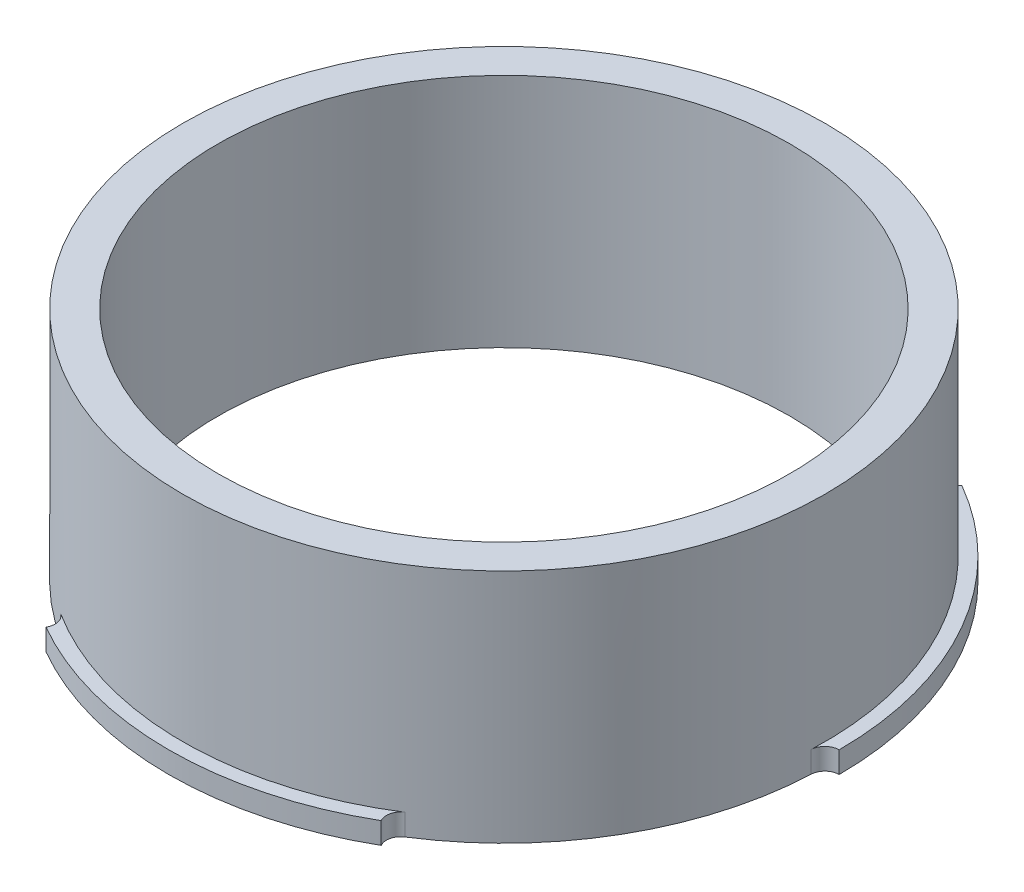
ISO-10303-21;
HEADER;
FILE_DESCRIPTION(('STEP AP214'),'2;1');
FILE_NAME('part.step','',(''),(''),'','','');
FILE_SCHEMA(('AUTOMOTIVE_DESIGN { 1 0 10303 214 1 1 1 1 }'));
ENDSEC;
DATA;
#1=APPLICATION_CONTEXT('core data for automotive mechanical design processes');
#2=APPLICATION_PROTOCOL_DEFINITION('international standard','automotive_design',2000,#1);
#3=PRODUCT_CONTEXT('',#1,'mechanical');
#4=PRODUCT('Part','Part','',(#3));
#5=PRODUCT_RELATED_PRODUCT_CATEGORY('part','',(#4));
#6=PRODUCT_DEFINITION_FORMATION('','',#4);
#7=PRODUCT_DEFINITION_CONTEXT('part definition',#1,'design');
#8=PRODUCT_DEFINITION('design','',#6,#7);
#9=PRODUCT_DEFINITION_SHAPE('','',#8);
#10=(LENGTH_UNIT() NAMED_UNIT(*) SI_UNIT(.MILLI.,.METRE.));
#11=(NAMED_UNIT(*) PLANE_ANGLE_UNIT() SI_UNIT($,.RADIAN.));
#12=(NAMED_UNIT(*) SI_UNIT($,.STERADIAN.) SOLID_ANGLE_UNIT());
#13=UNCERTAINTY_MEASURE_WITH_UNIT(LENGTH_MEASURE(1.E-05),#10,'distance_accuracy_value','');
#14=(GEOMETRIC_REPRESENTATION_CONTEXT(3) GLOBAL_UNCERTAINTY_ASSIGNED_CONTEXT((#13)) GLOBAL_UNIT_ASSIGNED_CONTEXT((#10,
#11,#12)) REPRESENTATION_CONTEXT('',''));
#15=CARTESIAN_POINT('',(0.,0.,0.));
#16=DIRECTION('',(0.,0.,1.));
#17=DIRECTION('',(1.,0.,0.));
#18=AXIS2_PLACEMENT_3D('',#15,#16,#17);
#19=CARTESIAN_POINT('',(0.,0.,0.));
#20=DIRECTION('',(0.,-1.,0.));
#21=DIRECTION('',(0.,0.,-1.));
#22=AXIS2_PLACEMENT_3D('',#19,#20,#21);
#23=PLANE('',#22);
#24=CARTESIAN_POINT('',(0.,0.,0.));
#25=DIRECTION('',(0.,-1.,0.));
#26=DIRECTION('',(0.,0.,-1.));
#27=AXIS2_PLACEMENT_3D('',#24,#25,#26);
#28=CIRCLE('',#27,23.455);
#29=CARTESIAN_POINT('',(-23.455,0.,0.));
#30=VERTEX_POINT('',#29);
#31=CARTESIAN_POINT('',(-11.7275,0.,-20.312625845764));
#32=VERTEX_POINT('',#31);
#33=EDGE_CURVE('E194',#30,#32,#28,.T.);
#34=ORIENTED_EDGE('',*,*,#33,.F.);
#35=DIRECTION('',(-1.,0.,0.));
#36=VECTOR('',#35,1.);
#37=CARTESIAN_POINT('',(-22.475,0.,0.));
#38=LINE('',#37,#36);
#39=CARTESIAN_POINT('',(-23.4536910741145,0.,0.));
#40=VERTEX_POINT('',#39);
#41=EDGE_CURVE('E187',#40,#30,#38,.T.);
#42=ORIENTED_EDGE('',*,*,#41,.F.);
#43=CARTESIAN_POINT('',(-23.4536910741145,0.,1.00000000000008));
#44=DIRECTION('',(0.,-1.,0.));
#45=DIRECTION('',(0.,0.,-1.));
#46=AXIS2_PLACEMENT_3D('',#43,#44,#45);
#47=CIRCLE('',#46,1.);
#48=CARTESIAN_POINT('',(-22.4545988025868,0.,0.95740149094789));
#49=VERTEX_POINT('',#48);
#50=EDGE_CURVE('E301',#40,#49,#47,.T.);
#51=ORIENTED_EDGE('',*,*,#50,.T.);
#52=CARTESIAN_POINT('',(0.,0.,0.));
#53=DIRECTION('',(0.,1.,0.));
#54=DIRECTION('',(0.,0.,1.));
#55=AXIS2_PLACEMENT_3D('',#52,#53,#54);
#56=CIRCLE('',#55,22.475);
#57=CARTESIAN_POINT('',(-10.3981653885115,0.,-19.9249537403017));
#58=VERTEX_POINT('',#57);
#59=EDGE_CURVE('E210',#58,#49,#56,.T.);
#60=ORIENTED_EDGE('',*,*,#59,.F.);
#61=CARTESIAN_POINT('',(-10.8608201332729,0.,-20.8114922826955));
#62=DIRECTION('',(0.,-1.,0.));
#63=DIRECTION('',(0.,0.,-1.));
#64=AXIS2_PLACEMENT_3D('',#61,#62,#63);
#65=CIRCLE('',#64,1.);
#66=CARTESIAN_POINT('',(-11.7268455370573,0.,-20.3114922826955));
#67=VERTEX_POINT('',#66);
#68=EDGE_CURVE('E48',#58,#67,#65,.T.);
#69=ORIENTED_EDGE('',*,*,#68,.T.);
#70=DIRECTION('',(0.500000000000001,0.,0.866025403784438));
#71=VECTOR('',#70,1.);
#72=CARTESIAN_POINT('',(-11.2375,0.,-19.4639209500552));
#73=LINE('',#72,#71);
#74=EDGE_CURVE('E330',#32,#67,#73,.T.);
#75=ORIENTED_EDGE('',*,*,#74,.F.);
#76=EDGE_LOOP('',(#34,#42,#51,#60,#69,#75));
#77=FACE_BOUND('',#76,.T.);
#78=ADVANCED_FACE('F39',(#77),#23,.F.);
#79=CARTESIAN_POINT('',(-12.0564334140752,0.,18.9675522493539));
#80=VERTEX_POINT('',#79);
#81=CARTESIAN_POINT('',(12.0564334140754,0.,18.9675522493538));
#82=VERTEX_POINT('',#81);
#83=EDGE_CURVE('E217',#80,#82,#56,.T.);
#84=ORIENTED_EDGE('',*,*,#83,.F.);
#85=CARTESIAN_POINT('',(-12.5928709408416,0.,19.8114922826956));
#86=DIRECTION('',(0.,-1.,0.));
#87=DIRECTION('',(0.,0.,-1.));
#88=AXIS2_PLACEMENT_3D('',#85,#86,#87);
#89=CIRCLE('',#88,1.);
#90=CARTESIAN_POINT('',(-11.7268455370571,0.,20.3114922826956));
#91=VERTEX_POINT('',#90);
#92=EDGE_CURVE('E185',#80,#91,#89,.T.);
#93=ORIENTED_EDGE('',*,*,#92,.T.);
#94=DIRECTION('',(0.499999999999995,0.,-0.866025403784442));
#95=VECTOR('',#94,1.);
#96=CARTESIAN_POINT('',(-11.2374999999999,0.,19.4639209500553));
#97=LINE('',#96,#95);
#98=CARTESIAN_POINT('',(-11.7274999999999,0.,20.3126258457641));
#99=VERTEX_POINT('',#98);
#100=EDGE_CURVE('E167',#99,#91,#97,.T.);
#101=ORIENTED_EDGE('',*,*,#100,.F.);
#102=CARTESIAN_POINT('',(11.7275000000002,0.,20.3126258457639));
#103=VERTEX_POINT('',#102);
#104=EDGE_CURVE('E183',#103,#99,#28,.T.);
#105=ORIENTED_EDGE('',*,*,#104,.F.);
#106=DIRECTION('',(0.500000000000007,0.,0.866025403784435));
#107=VECTOR('',#106,1.);
#108=CARTESIAN_POINT('',(11.2375000000002,0.,19.4639209500552));
#109=LINE('',#108,#107);
#110=CARTESIAN_POINT('',(11.7268455370574,0.,20.3114922826954));
#111=VERTEX_POINT('',#110);
#112=EDGE_CURVE('E188',#111,#103,#109,.T.);
#113=ORIENTED_EDGE('',*,*,#112,.F.);
#114=CARTESIAN_POINT('',(12.5928709408419,0.,19.8114922826954));
#115=DIRECTION('',(0.,-1.,0.));
#116=DIRECTION('',(0.,0.,-1.));
#117=AXIS2_PLACEMENT_3D('',#114,#115,#116);
#118=CIRCLE('',#117,1.);
#119=EDGE_CURVE('E289',#111,#82,#118,.T.);
#120=ORIENTED_EDGE('',*,*,#119,.T.);
#121=EDGE_LOOP('',(#84,#93,#101,#105,#113,#120));
#122=FACE_BOUND('',#121,.T.);
#123=ADVANCED_FACE('F181',(#122),#23,.F.);
#124=CARTESIAN_POINT('',(0.,-1.5,0.));
#125=DIRECTION('',(0.,1.,0.));
#126=DIRECTION('',(0.,0.,1.));
#127=AXIS2_PLACEMENT_3D('',#124,#125,#126);
#128=CYLINDRICAL_SURFACE('',#127,23.455);
#129=CARTESIAN_POINT('',(0.,-1.5,0.));
#130=DIRECTION('',(0.,-1.,0.));
#131=DIRECTION('',(0.,0.,-1.));
#132=AXIS2_PLACEMENT_3D('',#129,#130,#131);
#133=CIRCLE('',#132,23.455);
#134=CARTESIAN_POINT('',(-23.455,-1.5,0.));
#135=VERTEX_POINT('',#134);
#136=CARTESIAN_POINT('',(-11.7275,-1.5,-20.312625845764));
#137=VERTEX_POINT('',#136);
#138=EDGE_CURVE('E199',#135,#137,#133,.T.);
#139=ORIENTED_EDGE('',*,*,#138,.F.);
#140=DIRECTION('',(0.,1.,0.));
#141=VECTOR('',#140,1.);
#142=CARTESIAN_POINT('',(-23.455,-1.5,0.));
#143=LINE('',#142,#141);
#144=EDGE_CURVE('E176',#135,#30,#143,.T.);
#145=ORIENTED_EDGE('',*,*,#144,.T.);
#146=ORIENTED_EDGE('',*,*,#33,.T.);
#147=DIRECTION('',(0.,1.,0.));
#148=VECTOR('',#147,1.);
#149=CARTESIAN_POINT('',(-11.7275,-1.5,-20.312625845764));
#150=LINE('',#149,#148);
#151=EDGE_CURVE('E214',#32,#137,#150,.F.);
#152=ORIENTED_EDGE('',*,*,#151,.T.);
#153=EDGE_LOOP('',(#139,#145,#146,#152));
#154=FACE_BOUND('',#153,.T.);
#155=ADVANCED_FACE('F327',(#154),#128,.T.);
#156=ORIENTED_EDGE('',*,*,#104,.T.);
#157=DIRECTION('',(0.,1.,0.));
#158=VECTOR('',#157,1.);
#159=CARTESIAN_POINT('',(-11.7274999999999,-1.5,20.3126258457641));
#160=LINE('',#159,#158);
#161=CARTESIAN_POINT('',(-11.7274999999999,-1.5,20.3126258457641));
#162=VERTEX_POINT('',#161);
#163=EDGE_CURVE('E164',#99,#162,#160,.F.);
#164=ORIENTED_EDGE('',*,*,#163,.T.);
#165=CARTESIAN_POINT('',(11.7275000000002,-1.5,20.3126258457639));
#166=VERTEX_POINT('',#165);
#167=EDGE_CURVE('E313',#166,#162,#133,.T.);
#168=ORIENTED_EDGE('',*,*,#167,.F.);
#169=DIRECTION('',(0.,1.,0.));
#170=VECTOR('',#169,1.);
#171=CARTESIAN_POINT('',(11.7275000000002,-1.5,20.3126258457639));
#172=LINE('',#171,#170);
#173=EDGE_CURVE('E177',#166,#103,#172,.T.);
#174=ORIENTED_EDGE('',*,*,#173,.T.);
#175=EDGE_LOOP('',(#156,#164,#168,#174));
#176=FACE_BOUND('',#175,.T.);
#177=ADVANCED_FACE('F191',(#176),#128,.T.);
#178=CARTESIAN_POINT('',(0.,15.,0.));
#179=DIRECTION('',(0.,1.,0.));
#180=DIRECTION('',(0.,0.,1.));
#181=AXIS2_PLACEMENT_3D('',#178,#179,#180);
#182=PLANE('',#181);
#183=CARTESIAN_POINT('',(0.,15.,0.));
#184=DIRECTION('',(0.,1.,0.));
#185=DIRECTION('',(0.,0.,1.));
#186=AXIS2_PLACEMENT_3D('',#183,#184,#185);
#187=CIRCLE('',#186,22.475);
#188=CARTESIAN_POINT('',(0.,15.,22.475));
#189=VERTEX_POINT('',#188);
#190=EDGE_CURVE('E209',#189,#189,#187,.T.);
#191=ORIENTED_EDGE('',*,*,#190,.T.);
#192=EDGE_LOOP('',(#191));
#193=FACE_BOUND('',#192,.T.);
#194=CARTESIAN_POINT('',(0.,15.,0.));
#195=DIRECTION('',(0.,1.,0.));
#196=DIRECTION('',(0.,0.,1.));
#197=AXIS2_PLACEMENT_3D('',#194,#195,#196);
#198=CIRCLE('',#197,20.);
#199=CARTESIAN_POINT('',(0.,15.,20.));
#200=VERTEX_POINT('',#199);
#201=EDGE_CURVE('E205',#200,#200,#198,.T.);
#202=ORIENTED_EDGE('',*,*,#201,.F.);
#203=EDGE_LOOP('',(#202));
#204=FACE_BOUND('',#203,.T.);
#205=ADVANCED_FACE('F381',(#193,#204),#182,.T.);
#206=CARTESIAN_POINT('',(0.,15.,0.));
#207=DIRECTION('',(0.,-1.,0.));
#208=DIRECTION('',(0.,0.,-1.));
#209=AXIS2_PLACEMENT_3D('',#206,#207,#208);
#210=CYLINDRICAL_SURFACE('',#209,22.475);
#211=ORIENTED_EDGE('',*,*,#190,.F.);
#212=EDGE_LOOP('',(#211));
#213=FACE_BOUND('',#212,.T.);
#214=CARTESIAN_POINT('',(22.4545988025868,0.,0.957401490947571));
#215=VERTEX_POINT('',#214);
#216=CARTESIAN_POINT('',(10.3981653885115,0.,-19.9249537403017));
#217=VERTEX_POINT('',#216);
#218=EDGE_CURVE('E218',#215,#217,#56,.T.);
#219=ORIENTED_EDGE('',*,*,#218,.T.);
#220=DIRECTION('',(0.,-1.,0.));
#221=VECTOR('',#220,1.);
#222=CARTESIAN_POINT('',(10.3981653885115,15.,-19.9249537403017));
#223=LINE('',#222,#221);
#224=CARTESIAN_POINT('',(10.3981653885115,-1.5,-19.9249537403017));
#225=VERTEX_POINT('',#224);
#226=EDGE_CURVE('E257',#217,#225,#223,.T.);
#227=ORIENTED_EDGE('',*,*,#226,.T.);
#228=CARTESIAN_POINT('',(0.,-1.5,0.));
#229=DIRECTION('',(0.,-1.,0.));
#230=DIRECTION('',(0.,0.,-1.));
#231=AXIS2_PLACEMENT_3D('',#228,#229,#230);
#232=CIRCLE('',#231,22.475);
#233=CARTESIAN_POINT('',(-10.3981653885115,-1.5,-19.9249537403017));
#234=VERTEX_POINT('',#233);
#235=EDGE_CURVE('E350',#225,#234,#232,.F.);
#236=ORIENTED_EDGE('',*,*,#235,.T.);
#237=DIRECTION('',(0.,-1.,0.));
#238=VECTOR('',#237,1.);
#239=CARTESIAN_POINT('',(-10.3981653885115,15.,-19.9249537403017));
#240=LINE('',#239,#238);
#241=EDGE_CURVE('E239',#234,#58,#240,.F.);
#242=ORIENTED_EDGE('',*,*,#241,.T.);
#243=ORIENTED_EDGE('',*,*,#59,.T.);
#244=DIRECTION('',(0.,-1.,0.));
#245=VECTOR('',#244,1.);
#246=CARTESIAN_POINT('',(-22.4545988025868,15.,0.95740149094789));
#247=LINE('',#246,#245);
#248=CARTESIAN_POINT('',(-22.4545988025868,-1.5,0.95740149094789));
#249=VERTEX_POINT('',#248);
#250=EDGE_CURVE('E243',#49,#249,#247,.T.);
#251=ORIENTED_EDGE('',*,*,#250,.T.);
#252=CARTESIAN_POINT('',(0.,-1.5,0.));
#253=DIRECTION('',(0.,-1.,0.));
#254=DIRECTION('',(0.,0.,-1.));
#255=AXIS2_PLACEMENT_3D('',#252,#253,#254);
#256=CIRCLE('',#255,22.475);
#257=CARTESIAN_POINT('',(-12.0564334140752,-1.5,18.9675522493539));
#258=VERTEX_POINT('',#257);
#259=EDGE_CURVE('E334',#249,#258,#256,.F.);
#260=ORIENTED_EDGE('',*,*,#259,.T.);
#261=DIRECTION('',(0.,-1.,0.));
#262=VECTOR('',#261,1.);
#263=CARTESIAN_POINT('',(-12.0564334140752,15.,18.967552249354));
#264=LINE('',#263,#262);
#265=EDGE_CURVE('E246',#258,#80,#264,.F.);
#266=ORIENTED_EDGE('',*,*,#265,.T.);
#267=ORIENTED_EDGE('',*,*,#83,.T.);
#268=DIRECTION('',(0.,-1.,0.));
#269=VECTOR('',#268,1.);
#270=CARTESIAN_POINT('',(12.0564334140754,15.,18.9675522493538));
#271=LINE('',#270,#269);
#272=CARTESIAN_POINT('',(12.0564334140754,-1.5,18.9675522493538));
#273=VERTEX_POINT('',#272);
#274=EDGE_CURVE('E250',#82,#273,#271,.T.);
#275=ORIENTED_EDGE('',*,*,#274,.T.);
#276=CARTESIAN_POINT('',(0.,-1.5,0.));
#277=DIRECTION('',(0.,-1.,0.));
#278=DIRECTION('',(0.,0.,-1.));
#279=AXIS2_PLACEMENT_3D('',#276,#277,#278);
#280=CIRCLE('',#279,22.475);
#281=CARTESIAN_POINT('',(22.4545988025868,-1.5,0.957401490947571));
#282=VERTEX_POINT('',#281);
#283=EDGE_CURVE('E340',#273,#282,#280,.F.);
#284=ORIENTED_EDGE('',*,*,#283,.T.);
#285=DIRECTION('',(0.,-1.,0.));
#286=VECTOR('',#285,1.);
#287=CARTESIAN_POINT('',(22.4545988025868,15.,0.957401490947571));
#288=LINE('',#287,#286);
#289=EDGE_CURVE('E253',#282,#215,#288,.F.);
#290=ORIENTED_EDGE('',*,*,#289,.T.);
#291=EDGE_LOOP('',(#219,#227,#236,#242,#243,#251,#260,#266,#267,#275,#284,#290));
#292=FACE_BOUND('',#291,.T.);
#293=ADVANCED_FACE('F368',(#213,#292),#210,.T.);
#294=CARTESIAN_POINT('',(0.,15.,0.));
#295=DIRECTION('',(0.,-1.,0.));
#296=DIRECTION('',(0.,0.,-1.));
#297=AXIS2_PLACEMENT_3D('',#294,#295,#296);
#298=CYLINDRICAL_SURFACE('',#297,20.);
#299=ORIENTED_EDGE('',*,*,#201,.T.);
#300=EDGE_LOOP('',(#299));
#301=FACE_BOUND('',#300,.T.);
#302=CARTESIAN_POINT('',(0.,-1.5,0.));
#303=DIRECTION('',(0.,-1.,0.));
#304=DIRECTION('',(0.,0.,-1.));
#305=AXIS2_PLACEMENT_3D('',#302,#303,#304);
#306=CIRCLE('',#305,20.);
#307=CARTESIAN_POINT('',(0.,-1.5,-20.));
#308=VERTEX_POINT('',#307);
#309=EDGE_CURVE('E200',#308,#308,#306,.T.);
#310=ORIENTED_EDGE('',*,*,#309,.T.);
#311=EDGE_LOOP('',(#310));
#312=FACE_BOUND('',#311,.T.);
#313=ADVANCED_FACE('F357',(#301,#312),#298,.F.);
#314=CARTESIAN_POINT('',(0.,-1.5,0.));
#315=DIRECTION('',(0.,-1.,0.));
#316=DIRECTION('',(0.,0.,-1.));
#317=AXIS2_PLACEMENT_3D('',#314,#315,#316);
#318=PLANE('',#317);
#319=DIRECTION('',(1.,0.,0.));
#320=VECTOR('',#319,1.);
#321=CARTESIAN_POINT('',(0.,-1.5,0.));
#322=LINE('',#321,#320);
#323=CARTESIAN_POINT('',(-23.4536910741145,-1.5,0.));
#324=VERTEX_POINT('',#323);
#325=EDGE_CURVE('E324',#135,#324,#322,.T.);
#326=ORIENTED_EDGE('',*,*,#325,.F.);
#327=ORIENTED_EDGE('',*,*,#138,.T.);
#328=DIRECTION('',(-0.500000000000001,0.,-0.866025403784438));
#329=VECTOR('',#328,1.);
#330=CARTESIAN_POINT('',(0.,-1.5,0.));
#331=LINE('',#330,#329);
#332=CARTESIAN_POINT('',(-11.7268455370573,-1.5,-20.3114922826955));
#333=VERTEX_POINT('',#332);
#334=EDGE_CURVE('E321',#333,#137,#331,.T.);
#335=ORIENTED_EDGE('',*,*,#334,.F.);
#336=CARTESIAN_POINT('',(-10.8608201332729,-1.5,-20.8114922826955));
#337=DIRECTION('',(0.,-1.,0.));
#338=DIRECTION('',(0.,0.,-1.));
#339=AXIS2_PLACEMENT_3D('',#336,#337,#338);
#340=CIRCLE('',#339,1.);
#341=EDGE_CURVE('E11',#333,#234,#340,.F.);
#342=ORIENTED_EDGE('',*,*,#341,.T.);
#343=ORIENTED_EDGE('',*,*,#235,.F.);
#344=CARTESIAN_POINT('',(10.8608201332729,-1.5,-20.8114922826955));
#345=DIRECTION('',(0.,-1.,0.));
#346=DIRECTION('',(0.,0.,-1.));
#347=AXIS2_PLACEMENT_3D('',#344,#345,#346);
#348=CIRCLE('',#347,1.);
#349=CARTESIAN_POINT('',(11.7268455370573,-1.5,-20.3114922826955));
#350=VERTEX_POINT('',#349);
#351=EDGE_CURVE('E280',#225,#350,#348,.F.);
#352=ORIENTED_EDGE('',*,*,#351,.T.);
#353=DIRECTION('',(-0.500000000000001,0.,0.866025403784438));
#354=VECTOR('',#353,1.);
#355=CARTESIAN_POINT('',(0.,-1.5,0.));
#356=LINE('',#355,#354);
#357=CARTESIAN_POINT('',(11.7275,-1.5,-20.312625845764));
#358=VERTEX_POINT('',#357);
#359=EDGE_CURVE('E346',#358,#350,#356,.T.);
#360=ORIENTED_EDGE('',*,*,#359,.F.);
#361=CARTESIAN_POINT('',(23.455,-1.5,-2.56884513660793E-13));
#362=VERTEX_POINT('',#361);
#363=EDGE_CURVE('E203',#358,#362,#133,.T.);
#364=ORIENTED_EDGE('',*,*,#363,.T.);
#365=DIRECTION('',(1.,0.,0.));
#366=VECTOR('',#365,1.);
#367=CARTESIAN_POINT('',(0.,-1.5,0.));
#368=LINE('',#367,#366);
#369=CARTESIAN_POINT('',(23.4536910741145,-1.5,-2.52576630076397E-13));
#370=VERTEX_POINT('',#369);
#371=EDGE_CURVE('E427',#370,#362,#368,.T.);
#372=ORIENTED_EDGE('',*,*,#371,.F.);
#373=CARTESIAN_POINT('',(23.4536910741146,-1.5,0.999999999999743));
#374=DIRECTION('',(0.,-1.,0.));
#375=DIRECTION('',(0.,0.,-1.));
#376=AXIS2_PLACEMENT_3D('',#373,#374,#375);
#377=CIRCLE('',#376,1.);
#378=EDGE_CURVE('E286',#370,#282,#377,.F.);
#379=ORIENTED_EDGE('',*,*,#378,.T.);
#380=ORIENTED_EDGE('',*,*,#283,.F.);
#381=CARTESIAN_POINT('',(12.5928709408419,-1.5,19.8114922826954));
#382=DIRECTION('',(0.,-1.,0.));
#383=DIRECTION('',(0.,0.,-1.));
#384=AXIS2_PLACEMENT_3D('',#381,#382,#383);
#385=CIRCLE('',#384,1.);
#386=CARTESIAN_POINT('',(11.7268455370574,-1.5,20.3114922826954));
#387=VERTEX_POINT('',#386);
#388=EDGE_CURVE('E293',#273,#387,#385,.F.);
#389=ORIENTED_EDGE('',*,*,#388,.T.);
#390=DIRECTION('',(-0.500000000000007,0.,-0.866025403784435));
#391=VECTOR('',#390,1.);
#392=CARTESIAN_POINT('',(0.,-1.5,0.));
#393=LINE('',#392,#391);
#394=EDGE_CURVE('E421',#166,#387,#393,.T.);
#395=ORIENTED_EDGE('',*,*,#394,.F.);
#396=ORIENTED_EDGE('',*,*,#167,.T.);
#397=DIRECTION('',(-0.499999999999995,0.,0.866025403784442));
#398=VECTOR('',#397,1.);
#399=CARTESIAN_POINT('',(0.,-1.5,0.));
#400=LINE('',#399,#398);
#401=CARTESIAN_POINT('',(-11.7268455370572,-1.5,20.3114922826956));
#402=VERTEX_POINT('',#401);
#403=EDGE_CURVE('E170',#402,#162,#400,.T.);
#404=ORIENTED_EDGE('',*,*,#403,.F.);
#405=CARTESIAN_POINT('',(-12.5928709408416,-1.5,19.8114922826956));
#406=DIRECTION('',(0.,-1.,0.));
#407=DIRECTION('',(0.,0.,-1.));
#408=AXIS2_PLACEMENT_3D('',#405,#406,#407);
#409=CIRCLE('',#408,1.);
#410=EDGE_CURVE('E298',#402,#258,#409,.F.);
#411=ORIENTED_EDGE('',*,*,#410,.T.);
#412=ORIENTED_EDGE('',*,*,#259,.F.);
#413=CARTESIAN_POINT('',(-23.4536910741145,-1.5,1.00000000000008));
#414=DIRECTION('',(0.,-1.,0.));
#415=DIRECTION('',(0.,0.,-1.));
#416=AXIS2_PLACEMENT_3D('',#413,#414,#415);
#417=CIRCLE('',#416,1.);
#418=EDGE_CURVE('E305',#249,#324,#417,.F.);
#419=ORIENTED_EDGE('',*,*,#418,.T.);
#420=EDGE_LOOP('',(#326,#327,#335,#342,#343,#352,#360,#364,#372,#379,#380,#389,#395,#396,#404,
#411,#412,#419));
#421=FACE_BOUND('',#420,.T.);
#422=ORIENTED_EDGE('',*,*,#309,.F.);
#423=EDGE_LOOP('',(#422));
#424=FACE_BOUND('',#423,.T.);
#425=ADVANCED_FACE('F319',(#421,#424),#318,.T.);
#426=ORIENTED_EDGE('',*,*,#218,.F.);
#427=CARTESIAN_POINT('',(23.4536910741146,0.,0.999999999999743));
#428=DIRECTION('',(0.,-1.,0.));
#429=DIRECTION('',(0.,0.,-1.));
#430=AXIS2_PLACEMENT_3D('',#427,#428,#429);
#431=CIRCLE('',#430,1.);
#432=CARTESIAN_POINT('',(23.4536910741145,0.,-2.56870417624134E-13));
#433=VERTEX_POINT('',#432);
#434=EDGE_CURVE('E283',#215,#433,#431,.T.);
#435=ORIENTED_EDGE('',*,*,#434,.T.);
#436=DIRECTION('',(-1.,0.,0.));
#437=VECTOR('',#436,1.);
#438=CARTESIAN_POINT('',(22.475,0.,-2.46330733588707E-13));
#439=LINE('',#438,#437);
#440=CARTESIAN_POINT('',(23.455,0.,-2.56739074444567E-13));
#441=VERTEX_POINT('',#440);
#442=EDGE_CURVE('E432',#441,#433,#439,.T.);
#443=ORIENTED_EDGE('',*,*,#442,.F.);
#444=CARTESIAN_POINT('',(11.7275,0.,-20.312625845764));
#445=VERTEX_POINT('',#444);
#446=EDGE_CURVE('E193',#445,#441,#28,.T.);
#447=ORIENTED_EDGE('',*,*,#446,.F.);
#448=DIRECTION('',(0.500000000000001,0.,-0.866025403784438));
#449=VECTOR('',#448,1.);
#450=CARTESIAN_POINT('',(11.2375,0.,-19.4639209500552));
#451=LINE('',#450,#449);
#452=CARTESIAN_POINT('',(11.7268455370573,0.,-20.3114922826955));
#453=VERTEX_POINT('',#452);
#454=EDGE_CURVE('E333',#453,#445,#451,.T.);
#455=ORIENTED_EDGE('',*,*,#454,.F.);
#456=CARTESIAN_POINT('',(10.8608201332729,0.,-20.8114922826955));
#457=DIRECTION('',(0.,-1.,0.));
#458=DIRECTION('',(0.,0.,-1.));
#459=AXIS2_PLACEMENT_3D('',#456,#457,#458);
#460=CIRCLE('',#459,1.);
#461=EDGE_CURVE('E276',#453,#217,#460,.T.);
#462=ORIENTED_EDGE('',*,*,#461,.T.);
#463=EDGE_LOOP('',(#426,#435,#443,#447,#455,#462));
#464=FACE_BOUND('',#463,.T.);
#465=ADVANCED_FACE('F359',(#464),#23,.F.);
#466=ORIENTED_EDGE('',*,*,#446,.T.);
#467=DIRECTION('',(0.,1.,0.));
#468=VECTOR('',#467,1.);
#469=CARTESIAN_POINT('',(23.455,-1.5,-2.56884513660793E-13));
#470=LINE('',#469,#468);
#471=EDGE_CURVE('E226',#441,#362,#470,.F.);
#472=ORIENTED_EDGE('',*,*,#471,.T.);
#473=ORIENTED_EDGE('',*,*,#363,.F.);
#474=DIRECTION('',(0.,1.,0.));
#475=VECTOR('',#474,1.);
#476=CARTESIAN_POINT('',(11.7275,-1.5,-20.312625845764));
#477=LINE('',#476,#475);
#478=EDGE_CURVE('E222',#358,#445,#477,.T.);
#479=ORIENTED_EDGE('',*,*,#478,.T.);
#480=EDGE_LOOP('',(#466,#472,#473,#479));
#481=FACE_BOUND('',#480,.T.);
#482=ADVANCED_FACE('F365',(#481),#128,.T.);
#483=CARTESIAN_POINT('',(11.2375,-10.,-19.4639209500552));
#484=DIRECTION('',(0.866025403784438,0.,0.500000000000001));
#485=DIRECTION('',(0.500000000000001,0.,-0.866025403784438));
#486=AXIS2_PLACEMENT_3D('',#483,#484,#485);
#487=PLANE('',#486);
#488=ORIENTED_EDGE('',*,*,#359,.T.);
#489=DIRECTION('',(0.,1.,0.));
#490=VECTOR('',#489,1.);
#491=CARTESIAN_POINT('',(11.7268455370573,0.,-20.3114922826955));
#492=LINE('',#491,#490);
#493=EDGE_CURVE('E235',#350,#453,#492,.T.);
#494=ORIENTED_EDGE('',*,*,#493,.T.);
#495=ORIENTED_EDGE('',*,*,#454,.T.);
#496=ORIENTED_EDGE('',*,*,#478,.F.);
#497=EDGE_LOOP('',(#488,#494,#495,#496));
#498=FACE_BOUND('',#497,.T.);
#499=ADVANCED_FACE('F378',(#498),#487,.F.);
#500=CARTESIAN_POINT('',(-11.2375,-10.,-19.4639209500552));
#501=DIRECTION('',(-0.866025403784438,0.,0.500000000000001));
#502=DIRECTION('',(0.500000000000001,0.,0.866025403784438));
#503=AXIS2_PLACEMENT_3D('',#500,#501,#502);
#504=PLANE('',#503);
#505=ORIENTED_EDGE('',*,*,#74,.T.);
#506=DIRECTION('',(0.,1.,0.));
#507=VECTOR('',#506,1.);
#508=CARTESIAN_POINT('',(-11.7268455370573,-1.5,-20.3114922826955));
#509=LINE('',#508,#507);
#510=EDGE_CURVE('E61',#67,#333,#509,.F.);
#511=ORIENTED_EDGE('',*,*,#510,.T.);
#512=ORIENTED_EDGE('',*,*,#334,.T.);
#513=ORIENTED_EDGE('',*,*,#151,.F.);
#514=EDGE_LOOP('',(#505,#511,#512,#513));
#515=FACE_BOUND('',#514,.T.);
#516=ADVANCED_FACE('F329',(#515),#504,.F.);
#517=CARTESIAN_POINT('',(11.2375000000002,-10.,19.4639209500552));
#518=DIRECTION('',(-0.866025403784435,0.,0.500000000000007));
#519=DIRECTION('',(0.500000000000007,0.,0.866025403784435));
#520=AXIS2_PLACEMENT_3D('',#517,#518,#519);
#521=PLANE('',#520);
#522=ORIENTED_EDGE('',*,*,#394,.T.);
#523=DIRECTION('',(0.,1.,0.));
#524=VECTOR('',#523,1.);
#525=CARTESIAN_POINT('',(11.7268455370574,0.,20.3114922826954));
#526=LINE('',#525,#524);
#527=EDGE_CURVE('E263',#387,#111,#526,.T.);
#528=ORIENTED_EDGE('',*,*,#527,.T.);
#529=ORIENTED_EDGE('',*,*,#112,.T.);
#530=ORIENTED_EDGE('',*,*,#173,.F.);
#531=EDGE_LOOP('',(#522,#528,#529,#530));
#532=FACE_BOUND('',#531,.T.);
#533=ADVANCED_FACE('F461',(#532),#521,.F.);
#534=CARTESIAN_POINT('',(22.475,-10.,-2.46330733588707E-13));
#535=DIRECTION('',(0.,0.,-1.));
#536=DIRECTION('',(-1.,0.,0.));
#537=AXIS2_PLACEMENT_3D('',#534,#535,#536);
#538=PLANE('',#537);
#539=ORIENTED_EDGE('',*,*,#442,.T.);
#540=DIRECTION('',(0.,1.,0.));
#541=VECTOR('',#540,1.);
#542=CARTESIAN_POINT('',(23.4536910741145,-1.5,-2.56955914879065E-13));
#543=LINE('',#542,#541);
#544=EDGE_CURVE('E260',#433,#370,#543,.F.);
#545=ORIENTED_EDGE('',*,*,#544,.T.);
#546=ORIENTED_EDGE('',*,*,#371,.T.);
#547=ORIENTED_EDGE('',*,*,#471,.F.);
#548=EDGE_LOOP('',(#539,#545,#546,#547));
#549=FACE_BOUND('',#548,.T.);
#550=ADVANCED_FACE('F465',(#549),#538,.F.);
#551=CARTESIAN_POINT('',(-22.475,-10.,0.));
#552=DIRECTION('',(0.,0.,-1.));
#553=DIRECTION('',(-1.,0.,0.));
#554=AXIS2_PLACEMENT_3D('',#551,#552,#553);
#555=PLANE('',#554);
#556=ORIENTED_EDGE('',*,*,#325,.T.);
#557=DIRECTION('',(0.,1.,0.));
#558=VECTOR('',#557,1.);
#559=CARTESIAN_POINT('',(-23.4536910741145,0.,0.));
#560=LINE('',#559,#558);
#561=EDGE_CURVE('E270',#324,#40,#560,.T.);
#562=ORIENTED_EDGE('',*,*,#561,.T.);
#563=ORIENTED_EDGE('',*,*,#41,.T.);
#564=ORIENTED_EDGE('',*,*,#144,.F.);
#565=EDGE_LOOP('',(#556,#562,#563,#564));
#566=FACE_BOUND('',#565,.T.);
#567=ADVANCED_FACE('F415',(#566),#555,.F.);
#568=CARTESIAN_POINT('',(-11.2374999999999,-10.,19.4639209500553));
#569=DIRECTION('',(0.866025403784442,0.,0.499999999999995));
#570=DIRECTION('',(0.499999999999995,0.,-0.866025403784442));
#571=AXIS2_PLACEMENT_3D('',#568,#569,#570);
#572=PLANE('',#571);
#573=ORIENTED_EDGE('',*,*,#100,.T.);
#574=DIRECTION('',(0.,1.,0.));
#575=VECTOR('',#574,1.);
#576=CARTESIAN_POINT('',(-11.7268455370571,-1.5,20.3114922826956));
#577=LINE('',#576,#575);
#578=EDGE_CURVE('E267',#91,#402,#577,.F.);
#579=ORIENTED_EDGE('',*,*,#578,.T.);
#580=ORIENTED_EDGE('',*,*,#403,.T.);
#581=ORIENTED_EDGE('',*,*,#163,.F.);
#582=EDGE_LOOP('',(#573,#579,#580,#581));
#583=FACE_BOUND('',#582,.T.);
#584=ADVANCED_FACE('F166',(#583),#572,.F.);
#585=CARTESIAN_POINT('',(10.8608201332729,15.,-20.8114922826955));
#586=DIRECTION('',(0.,-1.,0.));
#587=DIRECTION('',(0.,0.,-1.));
#588=AXIS2_PLACEMENT_3D('',#585,#586,#587);
#589=CYLINDRICAL_SURFACE('',#588,1.);
#590=ORIENTED_EDGE('',*,*,#351,.F.);
#591=ORIENTED_EDGE('',*,*,#226,.F.);
#592=ORIENTED_EDGE('',*,*,#461,.F.);
#593=ORIENTED_EDGE('',*,*,#493,.F.);
#594=EDGE_LOOP('',(#590,#591,#592,#593));
#595=FACE_BOUND('',#594,.T.);
#596=ADVANCED_FACE('F388',(#595),#589,.F.);
#597=CARTESIAN_POINT('',(23.4536910741146,15.,0.999999999999743));
#598=DIRECTION('',(0.,-1.,0.));
#599=DIRECTION('',(0.,0.,-1.));
#600=AXIS2_PLACEMENT_3D('',#597,#598,#599);
#601=CYLINDRICAL_SURFACE('',#600,1.);
#602=ORIENTED_EDGE('',*,*,#378,.F.);
#603=ORIENTED_EDGE('',*,*,#544,.F.);
#604=ORIENTED_EDGE('',*,*,#434,.F.);
#605=ORIENTED_EDGE('',*,*,#289,.F.);
#606=EDGE_LOOP('',(#602,#603,#604,#605));
#607=FACE_BOUND('',#606,.T.);
#608=ADVANCED_FACE('F391',(#607),#601,.F.);
#609=CARTESIAN_POINT('',(12.5928709408419,15.,19.8114922826954));
#610=DIRECTION('',(0.,-1.,0.));
#611=DIRECTION('',(0.,0.,-1.));
#612=AXIS2_PLACEMENT_3D('',#609,#610,#611);
#613=CYLINDRICAL_SURFACE('',#612,1.);
#614=ORIENTED_EDGE('',*,*,#388,.F.);
#615=ORIENTED_EDGE('',*,*,#274,.F.);
#616=ORIENTED_EDGE('',*,*,#119,.F.);
#617=ORIENTED_EDGE('',*,*,#527,.F.);
#618=EDGE_LOOP('',(#614,#615,#616,#617));
#619=FACE_BOUND('',#618,.T.);
#620=ADVANCED_FACE('F395',(#619),#613,.F.);
#621=CARTESIAN_POINT('',(-12.5928709408416,15.,19.8114922826956));
#622=DIRECTION('',(0.,-1.,0.));
#623=DIRECTION('',(0.,0.,-1.));
#624=AXIS2_PLACEMENT_3D('',#621,#622,#623);
#625=CYLINDRICAL_SURFACE('',#624,1.);
#626=ORIENTED_EDGE('',*,*,#410,.F.);
#627=ORIENTED_EDGE('',*,*,#578,.F.);
#628=ORIENTED_EDGE('',*,*,#92,.F.);
#629=ORIENTED_EDGE('',*,*,#265,.F.);
#630=EDGE_LOOP('',(#626,#627,#628,#629));
#631=FACE_BOUND('',#630,.T.);
#632=ADVANCED_FACE('F399',(#631),#625,.F.);
#633=CARTESIAN_POINT('',(-23.4536910741145,15.,1.00000000000008));
#634=DIRECTION('',(0.,-1.,0.));
#635=DIRECTION('',(0.,0.,-1.));
#636=AXIS2_PLACEMENT_3D('',#633,#634,#635);
#637=CYLINDRICAL_SURFACE('',#636,1.);
#638=ORIENTED_EDGE('',*,*,#418,.F.);
#639=ORIENTED_EDGE('',*,*,#250,.F.);
#640=ORIENTED_EDGE('',*,*,#50,.F.);
#641=ORIENTED_EDGE('',*,*,#561,.F.);
#642=EDGE_LOOP('',(#638,#639,#640,#641));
#643=FACE_BOUND('',#642,.T.);
#644=ADVANCED_FACE('F402',(#643),#637,.F.);
#645=CARTESIAN_POINT('',(-10.8608201332729,15.,-20.8114922826955));
#646=DIRECTION('',(0.,-1.,0.));
#647=DIRECTION('',(0.,0.,-1.));
#648=AXIS2_PLACEMENT_3D('',#645,#646,#647);
#649=CYLINDRICAL_SURFACE('',#648,1.);
#650=ORIENTED_EDGE('',*,*,#341,.F.);
#651=ORIENTED_EDGE('',*,*,#510,.F.);
#652=ORIENTED_EDGE('',*,*,#68,.F.);
#653=ORIENTED_EDGE('',*,*,#241,.F.);
#654=EDGE_LOOP('',(#650,#651,#652,#653));
#655=FACE_BOUND('',#654,.T.);
#656=ADVANCED_FACE('F41',(#655),#649,.F.);
#657=CLOSED_SHELL('',(#78,#123,#155,#177,#205,#293,#313,#425,#465,#482,#499,#516,#533,#550,#567,
#584,#596,#608,#620,#632,#644,#656));
#658=MANIFOLD_SOLID_BREP('B2',#657);
#659=ADVANCED_BREP_SHAPE_REPRESENTATION('',(#18,#658),#14);
#660=SHAPE_DEFINITION_REPRESENTATION(#9,#659);
ENDSEC;
END-ISO-10303-21;
